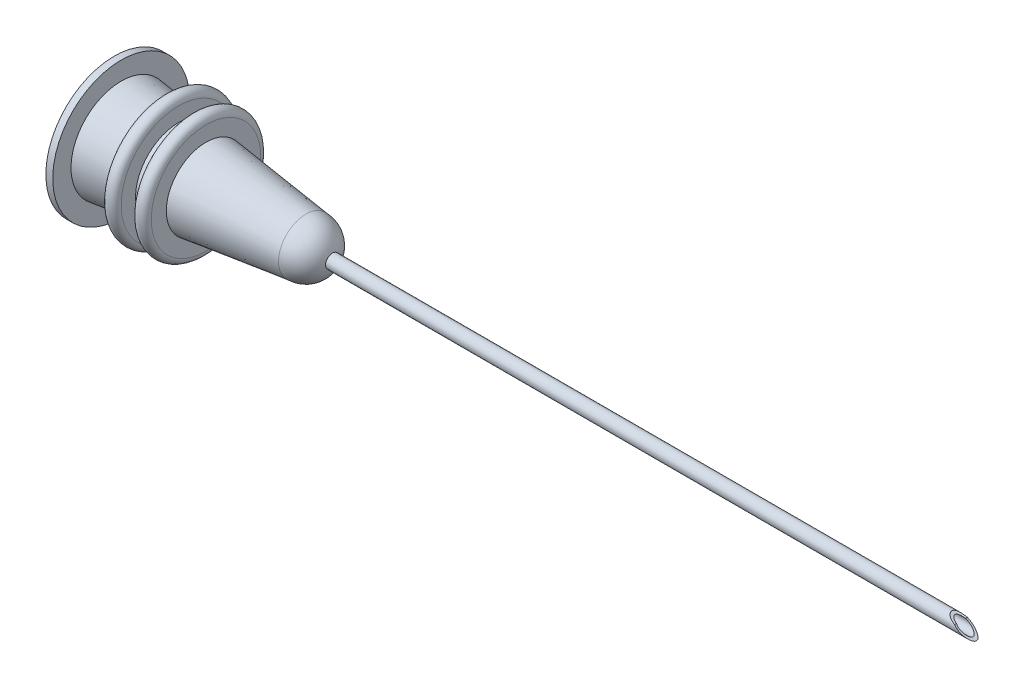
ISO-10303-21;
HEADER;
FILE_DESCRIPTION(('STEP AP214'),'2;1');
FILE_NAME('part.step','',(''),(''),'','','');
FILE_SCHEMA(('AUTOMOTIVE_DESIGN { 1 0 10303 214 1 1 1 1 }'));
ENDSEC;
DATA;
#1=APPLICATION_CONTEXT('core data for automotive mechanical design processes');
#2=APPLICATION_PROTOCOL_DEFINITION('international standard','automotive_design',2000,#1);
#3=PRODUCT_CONTEXT('',#1,'mechanical');
#4=PRODUCT('Part','Part','',(#3));
#5=PRODUCT_RELATED_PRODUCT_CATEGORY('part','',(#4));
#6=PRODUCT_DEFINITION_FORMATION('','',#4);
#7=PRODUCT_DEFINITION_CONTEXT('part definition',#1,'design');
#8=PRODUCT_DEFINITION('design','',#6,#7);
#9=PRODUCT_DEFINITION_SHAPE('','',#8);
#10=(LENGTH_UNIT() NAMED_UNIT(*) SI_UNIT(.MILLI.,.METRE.));
#11=(NAMED_UNIT(*) PLANE_ANGLE_UNIT() SI_UNIT($,.RADIAN.));
#12=(NAMED_UNIT(*) SI_UNIT($,.STERADIAN.) SOLID_ANGLE_UNIT());
#13=UNCERTAINTY_MEASURE_WITH_UNIT(LENGTH_MEASURE(1.E-05),#10,'distance_accuracy_value','');
#14=(GEOMETRIC_REPRESENTATION_CONTEXT(3) GLOBAL_UNCERTAINTY_ASSIGNED_CONTEXT((#13)) GLOBAL_UNIT_ASSIGNED_CONTEXT((#10,
#11,#12)) REPRESENTATION_CONTEXT('',''));
#15=CARTESIAN_POINT('',(0.,0.,0.));
#16=DIRECTION('',(0.,0.,1.));
#17=DIRECTION('',(1.,0.,0.));
#18=AXIS2_PLACEMENT_3D('',#15,#16,#17);
#19=CARTESIAN_POINT('',(0.,0.,0.));
#20=DIRECTION('',(0.,0.,1.));
#21=DIRECTION('',(1.,0.,0.));
#22=AXIS2_PLACEMENT_3D('',#19,#20,#21);
#23=SPHERICAL_SURFACE('',#22,2.);
#24=CARTESIAN_POINT('',(0.,0.,0.));
#25=DIRECTION('',(-1.,0.,0.));
#26=DIRECTION('',(0.,0.,1.));
#27=AXIS2_PLACEMENT_3D('',#24,#25,#26);
#28=SPHERICAL_SURFACE('',#27,2.);
#29=CARTESIAN_POINT('',(1.93649167310371,0.,0.));
#30=DIRECTION('',(-1.,0.,0.));
#31=DIRECTION('',(0.,0.,1.));
#32=AXIS2_PLACEMENT_3D('',#29,#30,#31);
#33=CIRCLE('',#32,0.5);
#34=CARTESIAN_POINT('',(1.93649167310371,0.,0.5));
#35=VERTEX_POINT('',#34);
#36=EDGE_CURVE('E210',#35,#35,#33,.F.);
#37=ORIENTED_EDGE('',*,*,#36,.F.);
#38=EDGE_LOOP('',(#37));
#39=FACE_BOUND('',#38,.T.);
#40=CARTESIAN_POINT('',(0.,0.,0.));
#41=DIRECTION('',(1.,0.,0.));
#42=DIRECTION('',(0.,0.,-1.));
#43=AXIS2_PLACEMENT_3D('',#40,#41,#42);
#44=CIRCLE('',#43,2.);
#45=CARTESIAN_POINT('',(0.,0.,-2.));
#46=VERTEX_POINT('',#45);
#47=EDGE_CURVE('E73',#46,#46,#44,.T.);
#48=ORIENTED_EDGE('',*,*,#47,.T.);
#49=EDGE_LOOP('',(#48));
#50=FACE_BOUND('',#49,.T.);
#51=ADVANCED_FACE('F38',(#39,#50),#28,.T.);
#52=CARTESIAN_POINT('',(0.,0.,0.));
#53=DIRECTION('',(-1.,0.,0.));
#54=DIRECTION('',(0.,0.,1.));
#55=AXIS2_PLACEMENT_3D('',#52,#53,#54);
#56=CONICAL_SURFACE('',#55,2.,0.122609377811233);
#57=CARTESIAN_POINT('',(-7.3,0.,0.));
#58=DIRECTION('',(1.,0.,0.));
#59=DIRECTION('',(0.,0.,-1.));
#60=AXIS2_PLACEMENT_3D('',#57,#58,#59);
#61=CIRCLE('',#60,2.89956069866158);
#62=CARTESIAN_POINT('',(-7.3,0.,-2.89956069866158));
#63=VERTEX_POINT('',#62);
#64=EDGE_CURVE('E75',#63,#63,#61,.T.);
#65=ORIENTED_EDGE('',*,*,#64,.T.);
#66=EDGE_LOOP('',(#65));
#67=FACE_BOUND('',#66,.T.);
#68=ORIENTED_EDGE('',*,*,#47,.F.);
#69=EDGE_LOOP('',(#68));
#70=FACE_BOUND('',#69,.T.);
#71=ADVANCED_FACE('F160',(#67,#70),#56,.T.);
#72=CARTESIAN_POINT('',(-7.3,4.,0.));
#73=DIRECTION('',(1.,0.,0.));
#74=DIRECTION('',(0.,0.,-1.));
#75=AXIS2_PLACEMENT_3D('',#72,#73,#74);
#76=PLANE('',#75);
#77=CARTESIAN_POINT('',(-7.3,0.,0.));
#78=DIRECTION('',(1.,0.,0.));
#79=DIRECTION('',(0.,0.,-1.));
#80=AXIS2_PLACEMENT_3D('',#77,#78,#79);
#81=CIRCLE('',#80,4.);
#82=CARTESIAN_POINT('',(-7.3,0.,-4.));
#83=VERTEX_POINT('',#82);
#84=EDGE_CURVE('E174',#83,#83,#81,.T.);
#85=ORIENTED_EDGE('',*,*,#84,.T.);
#86=EDGE_LOOP('',(#85));
#87=FACE_BOUND('',#86,.T.);
#88=ORIENTED_EDGE('',*,*,#64,.F.);
#89=EDGE_LOOP('',(#88));
#90=FACE_BOUND('',#89,.T.);
#91=ADVANCED_FACE('F157',(#87,#90),#76,.T.);
#92=CARTESIAN_POINT('',(-7.8,0.,0.));
#93=DIRECTION('',(1.,0.,0.));
#94=DIRECTION('',(0.,0.,-1.));
#95=AXIS2_PLACEMENT_3D('',#92,#93,#94);
#96=TOROIDAL_SURFACE('',#95,4.,0.5);
#97=CARTESIAN_POINT('',(-8.3,0.,0.));
#98=DIRECTION('',(1.,0.,0.));
#99=DIRECTION('',(0.,0.,-1.));
#100=AXIS2_PLACEMENT_3D('',#97,#98,#99);
#101=CIRCLE('',#100,4.);
#102=CARTESIAN_POINT('',(-8.3,0.,-4.));
#103=VERTEX_POINT('',#102);
#104=EDGE_CURVE('E176',#103,#103,#101,.T.);
#105=ORIENTED_EDGE('',*,*,#104,.T.);
#106=EDGE_LOOP('',(#105));
#107=FACE_BOUND('',#106,.T.);
#108=ORIENTED_EDGE('',*,*,#84,.F.);
#109=EDGE_LOOP('',(#108));
#110=FACE_BOUND('',#109,.T.);
#111=ADVANCED_FACE('F153',(#107,#110),#96,.T.);
#112=CARTESIAN_POINT('',(-8.3,4.,0.));
#113=DIRECTION('',(-1.,0.,0.));
#114=DIRECTION('',(0.,0.,1.));
#115=AXIS2_PLACEMENT_3D('',#112,#113,#114);
#116=PLANE('',#115);
#117=CARTESIAN_POINT('',(-8.3,0.,0.));
#118=DIRECTION('',(1.,0.,0.));
#119=DIRECTION('',(0.,0.,-1.));
#120=AXIS2_PLACEMENT_3D('',#117,#118,#119);
#121=CIRCLE('',#120,3.02278819162892);
#122=CARTESIAN_POINT('',(-8.3,0.,-3.02278819162892));
#123=VERTEX_POINT('',#122);
#124=EDGE_CURVE('E181',#123,#123,#121,.T.);
#125=ORIENTED_EDGE('',*,*,#124,.T.);
#126=EDGE_LOOP('',(#125));
#127=FACE_BOUND('',#126,.T.);
#128=ORIENTED_EDGE('',*,*,#104,.F.);
#129=EDGE_LOOP('',(#128));
#130=FACE_BOUND('',#129,.T.);
#131=ADVANCED_FACE('F149',(#127,#130),#116,.T.);
#132=CARTESIAN_POINT('',(-8.3,0.,0.));
#133=DIRECTION('',(-1.,0.,0.));
#134=DIRECTION('',(0.,0.,1.));
#135=AXIS2_PLACEMENT_3D('',#132,#133,#134);
#136=CONICAL_SURFACE('',#135,3.02278819162892,0.122609377811233);
#137=CARTESIAN_POINT('',(-9.3,0.,0.));
#138=DIRECTION('',(1.,0.,0.));
#139=DIRECTION('',(0.,0.,-1.));
#140=AXIS2_PLACEMENT_3D('',#137,#138,#139);
#141=CIRCLE('',#140,3.14601568459626);
#142=CARTESIAN_POINT('',(-9.3,0.,-3.14601568459626));
#143=VERTEX_POINT('',#142);
#144=EDGE_CURVE('E184',#143,#143,#141,.T.);
#145=ORIENTED_EDGE('',*,*,#144,.T.);
#146=EDGE_LOOP('',(#145));
#147=FACE_BOUND('',#146,.T.);
#148=ORIENTED_EDGE('',*,*,#124,.F.);
#149=EDGE_LOOP('',(#148));
#150=FACE_BOUND('',#149,.T.);
#151=ADVANCED_FACE('F145',(#147,#150),#136,.T.);
#152=CARTESIAN_POINT('',(-9.3,4.2,0.));
#153=DIRECTION('',(1.,0.,0.));
#154=DIRECTION('',(0.,0.,-1.));
#155=AXIS2_PLACEMENT_3D('',#152,#153,#154);
#156=PLANE('',#155);
#157=CARTESIAN_POINT('',(-9.3,0.,0.));
#158=DIRECTION('',(1.,0.,0.));
#159=DIRECTION('',(0.,0.,-1.));
#160=AXIS2_PLACEMENT_3D('',#157,#158,#159);
#161=CIRCLE('',#160,4.2);
#162=CARTESIAN_POINT('',(-9.3,0.,-4.2));
#163=VERTEX_POINT('',#162);
#164=EDGE_CURVE('E187',#163,#163,#161,.T.);
#165=ORIENTED_EDGE('',*,*,#164,.T.);
#166=EDGE_LOOP('',(#165));
#167=FACE_BOUND('',#166,.T.);
#168=ORIENTED_EDGE('',*,*,#144,.F.);
#169=EDGE_LOOP('',(#168));
#170=FACE_BOUND('',#169,.T.);
#171=ADVANCED_FACE('F141',(#167,#170),#156,.T.);
#172=CARTESIAN_POINT('',(-9.8,0.,0.));
#173=DIRECTION('',(1.,0.,0.));
#174=DIRECTION('',(0.,0.,-1.));
#175=AXIS2_PLACEMENT_3D('',#172,#173,#174);
#176=TOROIDAL_SURFACE('',#175,4.2,0.5);
#177=CARTESIAN_POINT('',(-10.3,0.,0.));
#178=DIRECTION('',(1.,0.,0.));
#179=DIRECTION('',(0.,0.,-1.));
#180=AXIS2_PLACEMENT_3D('',#177,#178,#179);
#181=CIRCLE('',#180,4.2);
#182=CARTESIAN_POINT('',(-10.3,0.,-4.2));
#183=VERTEX_POINT('',#182);
#184=EDGE_CURVE('E190',#183,#183,#181,.T.);
#185=ORIENTED_EDGE('',*,*,#184,.T.);
#186=EDGE_LOOP('',(#185));
#187=FACE_BOUND('',#186,.T.);
#188=ORIENTED_EDGE('',*,*,#164,.F.);
#189=EDGE_LOOP('',(#188));
#190=FACE_BOUND('',#189,.T.);
#191=ADVANCED_FACE('F137',(#187,#190),#176,.T.);
#192=CARTESIAN_POINT('',(-10.3,4.2,0.));
#193=DIRECTION('',(-1.,0.,0.));
#194=DIRECTION('',(0.,0.,1.));
#195=AXIS2_PLACEMENT_3D('',#192,#193,#194);
#196=PLANE('',#195);
#197=CARTESIAN_POINT('',(-10.3,0.,0.));
#198=DIRECTION('',(1.,0.,0.));
#199=DIRECTION('',(0.,0.,-1.));
#200=AXIS2_PLACEMENT_3D('',#197,#198,#199);
#201=CIRCLE('',#200,3.2692431775636);
#202=CARTESIAN_POINT('',(-10.3,0.,-3.2692431775636));
#203=VERTEX_POINT('',#202);
#204=EDGE_CURVE('E193',#203,#203,#201,.T.);
#205=ORIENTED_EDGE('',*,*,#204,.T.);
#206=EDGE_LOOP('',(#205));
#207=FACE_BOUND('',#206,.T.);
#208=ORIENTED_EDGE('',*,*,#184,.F.);
#209=EDGE_LOOP('',(#208));
#210=FACE_BOUND('',#209,.T.);
#211=ADVANCED_FACE('F133',(#207,#210),#196,.T.);
#212=CARTESIAN_POINT('',(-10.3,0.,0.));
#213=DIRECTION('',(-1.,0.,0.));
#214=DIRECTION('',(0.,0.,1.));
#215=AXIS2_PLACEMENT_3D('',#212,#213,#214);
#216=CONICAL_SURFACE('',#215,3.2692431775636,0.122609377811233);
#217=CARTESIAN_POINT('',(-13.5,0.,0.));
#218=DIRECTION('',(1.,0.,0.));
#219=DIRECTION('',(0.,0.,-1.));
#220=AXIS2_PLACEMENT_3D('',#217,#218,#219);
#221=CIRCLE('',#220,3.66357115505909);
#222=CARTESIAN_POINT('',(-13.5,0.,-3.66357115505909));
#223=VERTEX_POINT('',#222);
#224=EDGE_CURVE('E196',#223,#223,#221,.T.);
#225=ORIENTED_EDGE('',*,*,#224,.T.);
#226=EDGE_LOOP('',(#225));
#227=FACE_BOUND('',#226,.T.);
#228=ORIENTED_EDGE('',*,*,#204,.F.);
#229=EDGE_LOOP('',(#228));
#230=FACE_BOUND('',#229,.T.);
#231=ADVANCED_FACE('F129',(#227,#230),#216,.T.);
#232=CARTESIAN_POINT('',(-13.5,3.66357115505909,0.));
#233=DIRECTION('',(1.,0.,0.));
#234=DIRECTION('',(0.,0.,-1.));
#235=AXIS2_PLACEMENT_3D('',#232,#233,#234);
#236=PLANE('',#235);
#237=CARTESIAN_POINT('',(-13.5,0.,0.));
#238=DIRECTION('',(1.,0.,0.));
#239=DIRECTION('',(0.,0.,-1.));
#240=AXIS2_PLACEMENT_3D('',#237,#238,#239);
#241=CIRCLE('',#240,5.);
#242=CARTESIAN_POINT('',(-13.5,0.,-5.));
#243=VERTEX_POINT('',#242);
#244=EDGE_CURVE('E199',#243,#243,#241,.T.);
#245=ORIENTED_EDGE('',*,*,#244,.T.);
#246=EDGE_LOOP('',(#245));
#247=FACE_BOUND('',#246,.T.);
#248=ORIENTED_EDGE('',*,*,#224,.F.);
#249=EDGE_LOOP('',(#248));
#250=FACE_BOUND('',#249,.T.);
#251=ADVANCED_FACE('F125',(#247,#250),#236,.T.);
#252=CARTESIAN_POINT('',(0.,0.,0.));
#253=DIRECTION('',(1.,0.,0.));
#254=DIRECTION('',(0.,0.,-1.));
#255=AXIS2_PLACEMENT_3D('',#252,#253,#254);
#256=CYLINDRICAL_SURFACE('',#255,5.);
#257=CARTESIAN_POINT('',(-14.,0.,0.));
#258=DIRECTION('',(1.,0.,0.));
#259=DIRECTION('',(0.,0.,-1.));
#260=AXIS2_PLACEMENT_3D('',#257,#258,#259);
#261=CIRCLE('',#260,5.);
#262=CARTESIAN_POINT('',(-14.,0.,-5.));
#263=VERTEX_POINT('',#262);
#264=EDGE_CURVE('E202',#263,#263,#261,.T.);
#265=ORIENTED_EDGE('',*,*,#264,.T.);
#266=EDGE_LOOP('',(#265));
#267=FACE_BOUND('',#266,.T.);
#268=ORIENTED_EDGE('',*,*,#244,.F.);
#269=EDGE_LOOP('',(#268));
#270=FACE_BOUND('',#269,.T.);
#271=ADVANCED_FACE('F121',(#267,#270),#256,.T.);
#272=CARTESIAN_POINT('',(-14.,5.,0.));
#273=DIRECTION('',(-1.,0.,0.));
#274=DIRECTION('',(0.,0.,1.));
#275=AXIS2_PLACEMENT_3D('',#272,#273,#274);
#276=PLANE('',#275);
#277=CARTESIAN_POINT('',(-14.,0.,0.));
#278=DIRECTION('',(1.,0.,0.));
#279=DIRECTION('',(0.,0.,-1.));
#280=AXIS2_PLACEMENT_3D('',#277,#278,#279);
#281=CIRCLE('',#280,2.96951197563469);
#282=CARTESIAN_POINT('',(-14.,0.,-2.96951197563469));
#283=VERTEX_POINT('',#282);
#284=EDGE_CURVE('E205',#283,#283,#281,.T.);
#285=ORIENTED_EDGE('',*,*,#284,.T.);
#286=EDGE_LOOP('',(#285));
#287=FACE_BOUND('',#286,.T.);
#288=ORIENTED_EDGE('',*,*,#264,.F.);
#289=EDGE_LOOP('',(#288));
#290=FACE_BOUND('',#289,.T.);
#291=ADVANCED_FACE('F117',(#287,#290),#276,.T.);
#292=CARTESIAN_POINT('',(-14.,0.,0.));
#293=DIRECTION('',(-1.,0.,0.));
#294=DIRECTION('',(0.,0.,1.));
#295=AXIS2_PLACEMENT_3D('',#292,#293,#294);
#296=CONICAL_SURFACE('',#295,2.96951197563469,0.122609377811233);
#297=CARTESIAN_POINT('',(-0.999999999999999,0.,0.));
#298=DIRECTION('',(1.,0.,0.));
#299=DIRECTION('',(0.,0.,-1.));
#300=AXIS2_PLACEMENT_3D('',#297,#298,#299);
#301=CIRCLE('',#300,1.36755456705928);
#302=CARTESIAN_POINT('',(-0.999999999999999,0.,-1.36755456705928));
#303=VERTEX_POINT('',#302);
#304=EDGE_CURVE('E208',#303,#303,#301,.T.);
#305=ORIENTED_EDGE('',*,*,#304,.T.);
#306=EDGE_LOOP('',(#305));
#307=FACE_BOUND('',#306,.T.);
#308=ORIENTED_EDGE('',*,*,#284,.F.);
#309=EDGE_LOOP('',(#308));
#310=FACE_BOUND('',#309,.T.);
#311=ADVANCED_FACE('F113',(#307,#310),#296,.F.);
#312=CARTESIAN_POINT('',(-1.,1.36755456705928,0.));
#313=DIRECTION('',(-1.,0.,0.));
#314=DIRECTION('',(0.,0.,1.));
#315=AXIS2_PLACEMENT_3D('',#312,#313,#314);
#316=PLANE('',#315);
#317=ORIENTED_EDGE('',*,*,#304,.F.);
#318=EDGE_LOOP('',(#317));
#319=FACE_BOUND('',#318,.T.);
#320=CARTESIAN_POINT('',(-1.,0.,0.));
#321=DIRECTION('',(-1.,0.,0.));
#322=DIRECTION('',(0.,0.,1.));
#323=AXIS2_PLACEMENT_3D('',#320,#321,#322);
#324=CIRCLE('',#323,0.375);
#325=CARTESIAN_POINT('',(-1.,0.,0.375));
#326=VERTEX_POINT('',#325);
#327=EDGE_CURVE('E99',#326,#326,#324,.T.);
#328=ORIENTED_EDGE('',*,*,#327,.F.);
#329=EDGE_LOOP('',(#328));
#330=FACE_BOUND('',#329,.T.);
#331=ADVANCED_FACE('F108',(#319,#330),#316,.T.);
#332=CARTESIAN_POINT('',(49.,0.,0.));
#333=DIRECTION('',(-1.,0.,0.));
#334=DIRECTION('',(0.,0.,1.));
#335=AXIS2_PLACEMENT_3D('',#332,#333,#334);
#336=CYLINDRICAL_SURFACE('',#335,0.5);
#337=CARTESIAN_POINT('',(49.,0.,-0.5));
#338=CARTESIAN_POINT('',(48.9583904464747,7.99673527458866E-08,-0.499994803298946));
#339=CARTESIAN_POINT('',(48.9167847254722,0.000742115513359217,-0.500000699921479));
#340=CARTESIAN_POINT('',(48.8336253744731,0.00370895092813866,-0.499989394064269));
#341=CARTESIAN_POINT('',(48.792071745517,0.00593377995719239,-0.499972191130249));
#342=CARTESIAN_POINT('',(48.6674118848881,0.0148411402855793,-0.499817818955422));
#343=CARTESIAN_POINT('',(48.5844535810992,0.0237565455544011,-0.499577585148702));
#344=CARTESIAN_POINT('',(48.4169432825375,0.0478382860272779,-0.497856255421235));
#345=CARTESIAN_POINT('',(48.3324174936529,0.063183028788661,-0.496338385050073));
#346=CARTESIAN_POINT('',(48.1648805450954,0.10001312317582,-0.490255252748027));
#347=CARTESIAN_POINT('',(48.0818676852382,0.121491063501162,-0.485693659984475));
#348=CARTESIAN_POINT('',(47.9596030795196,0.157941447869739,-0.474562469753925));
#349=CARTESIAN_POINT('',(47.9194849914223,0.170698035666228,-0.470180555173614));
#350=CARTESIAN_POINT('',(47.8399333663788,0.197575650367584,-0.45953687138437));
#351=CARTESIAN_POINT('',(47.8005000872512,0.21169717855188,-0.45327440974508));
#352=CARTESIAN_POINT('',(47.722915270225,0.241049302382518,-0.438364892673407));
#353=CARTESIAN_POINT('',(47.6847553892126,0.256268768910115,-0.429739812563381));
#354=CARTESIAN_POINT('',(47.6097252192644,0.287713508448098,-0.40935689228756));
#355=CARTESIAN_POINT('',(47.5728534926489,0.303937600222464,-0.397602679622689));
#356=CARTESIAN_POINT('',(47.5128661440604,0.331540481008059,-0.374549876832645));
#357=CARTESIAN_POINT('',(47.4892365292266,0.342745772960858,-0.36438798634291));
#358=CARTESIAN_POINT('',(47.4430556379542,0.365261804181131,-0.341816851227128));
#359=CARTESIAN_POINT('',(47.4205059784337,0.376572673019895,-0.32940436225217));
#360=CARTESIAN_POINT('',(47.3768046784772,0.399057398946941,-0.301783420635359));
#361=CARTESIAN_POINT('',(47.3556647263046,0.41022960373391,-0.286554794683706));
#362=CARTESIAN_POINT('',(47.3157151122843,0.431825297276897,-0.252837038529335));
#363=CARTESIAN_POINT('',(47.2969006298143,0.4422503154037,-0.2343548525662));
#364=CARTESIAN_POINT('',(47.2687262244161,0.458149245183981,-0.200780968946547));
#365=CARTESIAN_POINT('',(47.2583587285163,0.464081033678559,-0.186758291166866));
#366=CARTESIAN_POINT('',(47.239560520521,0.474942938073186,-0.15709339331814));
#367=CARTESIAN_POINT('',(47.2311291954037,0.479873370960629,-0.141451688140036));
#368=CARTESIAN_POINT('',(47.2166666265028,0.488390104026615,-0.108480043032754));
#369=CARTESIAN_POINT('',(47.2106663897658,0.491959007160746,-0.0911315991674419));
#370=CARTESIAN_POINT('',(47.2018019565138,0.497249310117114,-0.0553843135358243));
#371=CARTESIAN_POINT('',(47.1989322410427,0.498973961159397,-0.0369873806716265));
#372=CARTESIAN_POINT('',(47.1968218353719,0.500241795186489,-0.0027034684724461));
#373=CARTESIAN_POINT('',(47.1971000086102,0.500074206118567,0.013144598737856));
#374=CARTESIAN_POINT('',(47.2001189825966,0.498261940402622,0.0445176814329099));
#375=CARTESIAN_POINT('',(47.2028601919027,0.496617018700895,0.0600426428850881));
#376=CARTESIAN_POINT('',(47.2103117895527,0.492171377414629,0.0892841279112567));
#377=CARTESIAN_POINT('',(47.2148766121181,0.489456261078017,0.10305196613143));
#378=CARTESIAN_POINT('',(47.2256655709194,0.483084900462217,0.129678971269599));
#379=CARTESIAN_POINT('',(47.2318901059111,0.479428430024362,0.142537918880704));
#380=CARTESIAN_POINT('',(47.2496322634132,0.46909783865977,0.17424637431691));
#381=CARTESIAN_POINT('',(47.262150493485,0.46188787551741,0.192361180484092));
#382=CARTESIAN_POINT('',(47.28960869251,0.446344293853152,0.226105466199458));
#383=CARTESIAN_POINT('',(47.3045554639449,0.438007530460684,0.24172771300061));
#384=CARTESIAN_POINT('',(47.3462442427515,0.415206129522191,0.279946994603086));
#385=CARTESIAN_POINT('',(47.3744316882328,0.400222814352495,0.300642256121825));
#386=CARTESIAN_POINT('',(47.4335560090162,0.3699250599564,0.337223128487323));
#387=CARTESIAN_POINT('',(47.4644987112064,0.354609973418644,0.353098217328232));
#388=CARTESIAN_POINT('',(47.5275346471119,0.324619728109163,0.380827680333696));
#389=CARTESIAN_POINT('',(47.5595933290358,0.309937908317895,0.392754926319976));
#390=CARTESIAN_POINT('',(47.6249231613908,0.281235941951374,0.41378923021251));
#391=CARTESIAN_POINT('',(47.6581954666761,0.267216456369493,0.42289351925014));
#392=CARTESIAN_POINT('',(47.759475430869,0.226410289778905,0.446930135802772));
#393=CARTESIAN_POINT('',(47.8288015705031,0.200945266527597,0.458530024019008));
#394=CARTESIAN_POINT('',(47.9753984465591,0.152363436157451,0.476978485461348));
#395=CARTESIAN_POINT('',(48.0528461316099,0.129625755155942,0.4833438817778));
#396=CARTESIAN_POINT('',(48.2093982866885,0.0895036853085824,0.492351913364944));
#397=CARTESIAN_POINT('',(48.2885045391687,0.0721254082060551,0.494990310631259));
#398=CARTESIAN_POINT('',(48.4476853774398,0.042906612818956,0.498371474445398));
#399=CARTESIAN_POINT('',(48.5277590577392,0.0310612740754617,0.499115893607074));
#400=CARTESIAN_POINT('',(48.6884861864852,0.0129536418559133,0.499914979986723));
#401=CARTESIAN_POINT('',(48.7691391567331,0.00668718103451292,0.499970162457228));
#402=CARTESIAN_POINT('',(48.8749130413677,0.0021462244024727,0.499995660635806));
#403=CARTESIAN_POINT('',(48.8999422888126,0.00134085138135597,0.499998263581664));
#404=CARTESIAN_POINT('',(48.9499804378618,0.000268132540508595,0.500000442140695));
#405=CARTESIAN_POINT('',(48.9749893248102,1.03172217391055E-07,0.500000021603135));
#406=CARTESIAN_POINT('',(49.,0.,0.5));
#407=B_SPLINE_CURVE_WITH_KNOTS('',3,(#337,#338,#339,#340,#341,#342,#343,#344,#345,#346,#347,
#348,#349,#350,#351,#352,#353,#354,#355,#356,#357,#358,#359,#360,#361,#362,#363,#364,#365,#366,
#367,#368,#369,#370,#371,#372,#373,#374,#375,#376,#377,#378,#379,#380,#381,#382,#383,#384,#385,
#386,#387,#388,#389,#390,#391,#392,#393,#394,#395,#396,#397,#398,#399,#400,#401,#402,#403,#404,
#405,#406),.UNSPECIFIED.,.F.,.F.,(4,2,2,2,2,2,2,2,2,2,2,2,2,2,2,2,2,2,2,2,2,2,2,2,2,2,2,2,2,2,2,
2,2,2,4),(0.,0.124814384042121,0.249631222728075,0.499704596565313,0.757232215496293,
1.01444994778906,1.14137187366669,1.26834059049329,1.39416624727195,1.51984666892835,
1.60393189119591,1.68813930435157,1.77297510464743,1.85763198366323,1.91273336331846,
1.9678172728955,2.02358315965483,2.07925057419941,2.12654068640841,2.1738386443508,
2.21794082486963,2.26205361076343,2.33116467754336,2.40047277570452,2.51396061966749,
2.62769444530129,2.73919358516794,2.85080174439061,3.07452291406234,3.31711066821702,
3.55997404966043,3.80262544488755,4.04509543039419,4.12021806659996,4.19524507938975),.UNSPECIFIED.);
#408=CARTESIAN_POINT('',(47.8614010421319,0.190378811232083,-0.462337439792473));
#409=VERTEX_POINT('',#408);
#410=CARTESIAN_POINT('',(47.8614010421319,0.190378811232083,0.462337439792473));
#411=VERTEX_POINT('',#410);
#412=EDGE_CURVE('E92',#409,#411,#407,.T.);
#413=ORIENTED_EDGE('',*,*,#412,.F.);
#414=CARTESIAN_POINT('',(49.,-0.5,0.));
#415=CARTESIAN_POINT('',(49.0000005124618,-0.500000207355729,-0.0125909528909839));
#416=CARTESIAN_POINT('',(48.9988973767319,-0.499519234809843,-0.0251803973692698));
#417=CARTESIAN_POINT('',(48.9946350092743,-0.497655349963925,-0.0499385012717421));
#418=CARTESIAN_POINT('',(48.9914732444924,-0.496271326494273,-0.0621066228241094));
#419=CARTESIAN_POINT('',(48.9823563092796,-0.492262479074227,-0.0889280195617167));
#420=CARTESIAN_POINT('',(48.9758772393713,-0.48940345588389,-0.103364580234847));
#421=CARTESIAN_POINT('',(48.9609393218666,-0.482760971508321,-0.130935078608321));
#422=CARTESIAN_POINT('',(48.9524758727961,-0.478975360797057,-0.144065886120113));
#423=CARTESIAN_POINT('',(48.9275153352082,-0.467710472161099,-0.178239045217897));
#424=CARTESIAN_POINT('',(48.9096659117157,-0.459553038460227,-0.198054079829814));
#425=CARTESIAN_POINT('',(48.8717810342524,-0.441927259547519,-0.23476605590274));
#426=CARTESIAN_POINT('',(48.851739327943,-0.432455143089352,-0.251654276504805));
#427=CARTESIAN_POINT('',(48.8092878959211,-0.412017024766676,-0.283945989411702));
#428=CARTESIAN_POINT('',(48.7868090098062,-0.400998548477215,-0.299223979781188));
#429=CARTESIAN_POINT('',(48.7409833987655,-0.378086153442417,-0.327694695149538));
#430=CARTESIAN_POINT('',(48.7176358116827,-0.366191352847973,-0.340885276385706));
#431=CARTESIAN_POINT('',(48.6467011525839,-0.32931917044403,-0.377846909625646));
#432=CARTESIAN_POINT('',(48.5983064931674,-0.303194218455586,-0.398948572353165));
#433=CARTESIAN_POINT('',(48.5116434295749,-0.254472553826571,-0.431150455632949));
#434=CARTESIAN_POINT('',(48.4735100250777,-0.232378654642426,-0.443430906903332));
#435=CARTESIAN_POINT('',(48.3971104600884,-0.186726812587658,-0.464506651404057));
#436=CARTESIAN_POINT('',(48.3588442312142,-0.163167958156986,-0.473299749030291));
#437=CARTESIAN_POINT('',(48.282573326214,-0.114760315750188,-0.487302082271064));
#438=CARTESIAN_POINT('',(48.2445682950705,-0.0899140191581811,-0.49251798077831));
#439=CARTESIAN_POINT('',(48.1690259956952,-0.0390331707596784,-0.499133481519282));
#440=CARTESIAN_POINT('',(48.1314886539613,-0.0129988087461989,-0.500533691153066));
#441=CARTESIAN_POINT('',(48.0482455780525,0.046445257302097,-0.498927562939486));
#442=CARTESIAN_POINT('',(48.0027441156513,0.080124145655362,-0.494781695664623));
#443=CARTESIAN_POINT('',(47.9137717109363,0.148326395128305,-0.478773825724017));
#444=CARTESIAN_POINT('',(47.8702974622003,0.182848230447305,-0.466924894940705));
#445=CARTESIAN_POINT('',(47.7990873753449,0.241272096008406,-0.438752162381982));
#446=CARTESIAN_POINT('',(47.7705107135906,0.265284381245068,-0.424801054172238));
#447=CARTESIAN_POINT('',(47.7157304162491,0.312315004782396,-0.391519319774966));
#448=CARTESIAN_POINT('',(47.6895233727716,0.335334744750031,-0.372196587332175));
#449=CARTESIAN_POINT('',(47.6475525791964,0.372905362585786,-0.333831173526176));
#450=CARTESIAN_POINT('',(47.6309360033177,0.388005428325768,-0.316265799889607));
#451=CARTESIAN_POINT('',(47.600087878209,0.41637410571904,-0.277849988670346));
#452=CARTESIAN_POINT('',(47.5858529458001,0.429645310499886,-0.257004294023516));
#453=CARTESIAN_POINT('',(47.5630874986448,0.451070990568401,-0.216668103391159));
#454=CARTESIAN_POINT('',(47.5539856241199,0.4597171666662,-0.197764164466051));
#455=CARTESIAN_POINT('',(47.5381924423697,0.474805195656867,-0.15814025441044));
#456=CARTESIAN_POINT('',(47.5314998568906,0.481248217347275,-0.137421253542019));
#457=CARTESIAN_POINT('',(47.520893337094,0.491493306016106,-0.0944708469397563));
#458=CARTESIAN_POINT('',(47.5170001579987,0.495275641878065,-0.0722294566734642));
#459=CARTESIAN_POINT('',(47.5123694610005,0.499777274653022,-0.0271168805342242));
#460=CARTESIAN_POINT('',(47.5116300022618,0.500498455434737,-0.00424609072665163));
#461=CARTESIAN_POINT('',(47.5132539771268,0.498918024966597,0.0385080169191395));
#462=CARTESIAN_POINT('',(47.5152553379314,0.496969128003496,0.0584201718955558));
#463=CARTESIAN_POINT('',(47.5216131970898,0.490801109770033,0.0974963358523563));
#464=CARTESIAN_POINT('',(47.5259697582255,0.486581927981493,0.11666032487454));
#465=CARTESIAN_POINT('',(47.5368657837836,0.476087301402336,0.154020331730885));
#466=CARTESIAN_POINT('',(47.5434308295209,0.469787776017919,0.172201964800403));
#467=CARTESIAN_POINT('',(47.5584250557673,0.455501199935989,0.207060888106525));
#468=CARTESIAN_POINT('',(47.5668550894069,0.447513377009064,0.223737484939516));
#469=CARTESIAN_POINT('',(47.589714841899,0.426033266086479,0.263080275449753));
#470=CARTESIAN_POINT('',(47.6050799191378,0.411741513891853,0.284768630916899));
#471=CARTESIAN_POINT('',(47.6383818306927,0.381219503320736,0.324503752948605));
#472=CARTESIAN_POINT('',(47.6563246044694,0.364984782841593,0.342541870930251));
#473=CARTESIAN_POINT('',(47.7025210143635,0.323858118593175,0.382444080092323));
#474=CARTESIAN_POINT('',(47.7318113331719,0.298327089514048,0.402441902171906));
#475=CARTESIAN_POINT('',(47.7929800658604,0.246347043710287,0.436205873847513));
#476=CARTESIAN_POINT('',(47.8248621657757,0.219896751308745,0.449962958336858));
#477=CARTESIAN_POINT('',(47.9078283958452,0.152866087287851,0.478091109284277));
#478=CARTESIAN_POINT('',(47.9600964867726,0.112262309511031,0.488887498694187));
#479=CARTESIAN_POINT('',(48.0670020784229,0.0326366728156302,0.500558963882678));
#480=CARTESIAN_POINT('',(48.1216472997682,-0.00637908857633311,0.501398843337303));
#481=CARTESIAN_POINT('',(48.2144319440119,-0.0698560734920324,0.495765744064803));
#482=CARTESIAN_POINT('',(48.2522738905908,-0.094988743896891,0.491540865370264));
#483=CARTESIAN_POINT('',(48.3282187737208,-0.143962449973576,0.479490713597586));
#484=CARTESIAN_POINT('',(48.36632169173,-0.16780357635783,0.471665693745097));
#485=CARTESIAN_POINT('',(48.4423634200552,-0.213988917503074,0.452582378861437));
#486=CARTESIAN_POINT('',(48.480302304127,-0.236338472559676,0.441337233440527));
#487=CARTESIAN_POINT('',(48.5558126738647,-0.2795150042471,0.415339597052178));
#488=CARTESIAN_POINT('',(48.593384455557,-0.300343313786816,0.400590225866148));
#489=CARTESIAN_POINT('',(48.6559590907703,-0.334018864297569,0.372489684595177));
#490=CARTESIAN_POINT('',(48.6811861567437,-0.347310237810931,0.360166517670907));
#491=CARTESIAN_POINT('',(48.7311002530146,-0.373081913110665,0.333400458089945));
#492=CARTESIAN_POINT('',(48.7557846268843,-0.385558643647922,0.318949032528369));
#493=CARTESIAN_POINT('',(48.8111139461936,-0.412976311430085,0.283029235472363));
#494=CARTESIAN_POINT('',(48.841400607675,-0.427576356855475,0.260743111463114));
#495=CARTESIAN_POINT('',(48.8982701147684,-0.454348852429624,0.210646212952154));
#496=CARTESIAN_POINT('',(48.9248834069582,-0.466541670631287,0.182886151744353));
#497=CARTESIAN_POINT('',(48.9550180833392,-0.480113210586274,0.140092279107696));
#498=CARTESIAN_POINT('',(48.962358149907,-0.483392844161234,0.128406724746646));
#499=CARTESIAN_POINT('',(48.975475938997,-0.489223989864512,0.104007762155106));
#500=CARTESIAN_POINT('',(48.9812549401945,-0.491776098007413,0.0912952063029807));
#501=CARTESIAN_POINT('',(48.9904546486923,-0.495824904565758,0.0656917407073111));
#502=CARTESIAN_POINT('',(48.9939902333964,-0.497373123463732,0.0528515671350373));
#503=CARTESIAN_POINT('',(48.9987608387592,-0.499459771770725,0.0266731567627449));
#504=CARTESIAN_POINT('',(48.9999994572251,-0.499999780378776,0.0133357323105378));
#505=CARTESIAN_POINT('',(49.,-0.5,0.));
#506=B_SPLINE_CURVE_WITH_KNOTS('',3,(#414,#415,#416,#417,#418,#419,#420,#421,#422,#423,#424,
#425,#426,#427,#428,#429,#430,#431,#432,#433,#434,#435,#436,#437,#438,#439,#440,#441,#442,#443,
#444,#445,#446,#447,#448,#449,#450,#451,#452,#453,#454,#455,#456,#457,#458,#459,#460,#461,#462,
#463,#464,#465,#466,#467,#468,#469,#470,#471,#472,#473,#474,#475,#476,#477,#478,#479,#480,#481,
#482,#483,#484,#485,#486,#487,#488,#489,#490,#491,#492,#493,#494,#495,#496,#497,#498,#499,#500,
#501,#502,#503,#504,#505),.UNSPECIFIED.,.T.,.F.,(4,2,2,2,2,2,2,2,2,2,2,2,2,2,2,2,2,2,2,2,2,2,2,
2,2,2,2,2,2,2,2,2,2,2,2,2,2,2,2,2,2,2,2,2,2,4),(0.,0.0377171393239249,0.0754807758880129,
0.123446598823013,0.171524766870325,0.254722773433654,0.33816457033518,0.426012773857256,
0.51395061977075,0.690155197571436,0.827274241281502,0.964479477289651,1.10142845559556,
1.23835563241803,1.40818053954057,1.57771800818296,1.69692531488622,1.81595836096603,
1.90120441387978,1.98632832532865,2.05414059542095,2.12191683434377,2.19019053567791,
2.25842221452333,2.31845737033666,2.37849412656513,2.43925172309344,2.50003717059807,
2.590063563213,2.68030082221582,2.81067025081278,2.94122844844337,3.14131553751746,
3.34210972563428,3.47882789418194,3.61553644775784,3.75172589353516,3.88779454241784,
3.98091668391422,4.07442289530074,4.19516734257763,4.31484167914277,4.35728560279303,
4.39969465428998,4.43970555935149,4.47965374102591),.UNSPECIFIED.);
#507=EDGE_CURVE('E52',#411,#409,#506,.T.);
#508=ORIENTED_EDGE('',*,*,#507,.F.);
#509=EDGE_LOOP('',(#413,#508));
#510=FACE_BOUND('',#509,.T.);
#511=ORIENTED_EDGE('',*,*,#36,.T.);
#512=EDGE_LOOP('',(#511));
#513=FACE_BOUND('',#512,.T.);
#514=ADVANCED_FACE('F104',(#510,#513),#336,.T.);
#515=CARTESIAN_POINT('',(49.,0.,0.));
#516=DIRECTION('',(-1.,0.,0.));
#517=DIRECTION('',(0.,0.,1.));
#518=AXIS2_PLACEMENT_3D('',#515,#516,#517);
#519=CYLINDRICAL_SURFACE('',#518,0.375);
#520=CARTESIAN_POINT('',(49.,0.,-0.375));
#521=CARTESIAN_POINT('',(48.9687172882148,-1.55684867949866E-08,-0.374997730410719));
#522=CARTESIAN_POINT('',(48.9374360239019,0.000419420066799926,-0.375000271117309));
#523=CARTESIAN_POINT('',(48.874896182891,0.00209668931991924,-0.374995508331238));
#524=CARTESIAN_POINT('',(48.8436376060489,0.00335451756462611,-0.374988204901666));
#525=CARTESIAN_POINT('',(48.7498906909202,0.00838668396821072,-0.374922307720044));
#526=CARTESIAN_POINT('',(48.6874655632978,0.0134197032169251,-0.374819686800747));
#527=CARTESIAN_POINT('',(48.5621598569765,0.0269151720440397,-0.374094934786773));
#528=CARTESIAN_POINT('',(48.4992840658622,0.0354217984014876,-0.373465997701552));
#529=CARTESIAN_POINT('',(48.3741390689933,0.0558283461192805,-0.37096224739));
#530=CARTESIAN_POINT('',(48.3118696256459,0.0677268780926002,-0.369087943871211));
#531=CARTESIAN_POINT('',(48.1762176334091,0.0974896777727221,-0.362494425679048));
#532=CARTESIAN_POINT('',(48.1030038738212,0.116061498129649,-0.357296922874498));
#533=CARTESIAN_POINT('',(47.9948402994412,0.147231486687495,-0.345062996580087));
#534=CARTESIAN_POINT('',(47.9591485808886,0.158142346836339,-0.340262792015744));
#535=CARTESIAN_POINT('',(47.88842924391,0.180995938402501,-0.3286805707061));
#536=CARTESIAN_POINT('',(47.8534012720156,0.192938100643652,-0.32189964226183));
#537=CARTESIAN_POINT('',(47.7895569449259,0.215826417103354,-0.306922076587049));
#538=CARTESIAN_POINT('',(47.7606088701963,0.226646181046269,-0.299099759685881));
#539=CARTESIAN_POINT('',(47.7035658377778,0.248816281045741,-0.28093080452556));
#540=CARTESIAN_POINT('',(47.6754742867236,0.260168369953244,-0.270575272616138));
#541=CARTESIAN_POINT('',(47.6204415537865,0.28321262037368,-0.246374628288589));
#542=CARTESIAN_POINT('',(47.5935207909359,0.294907299719374,-0.232484682520518));
#543=CARTESIAN_POINT('',(47.542453067027,0.317812018894777,-0.200037013049557));
#544=CARTESIAN_POINT('',(47.5182875296401,0.329024941946787,-0.18151361847955));
#545=CARTESIAN_POINT('',(47.4885879956568,0.343147006404318,-0.151517482910573));
#546=CARTESIAN_POINT('',(47.4807544780891,0.346912633235461,-0.14274131572748));
#547=CARTESIAN_POINT('',(47.466149732505,0.353991709482664,-0.124153987343393));
#548=CARTESIAN_POINT('',(47.4593790714284,0.357304917451597,-0.114342278407457));
#549=CARTESIAN_POINT('',(47.4471951459178,0.363306820800262,-0.0935488790342786));
#550=CARTESIAN_POINT('',(47.441798713505,0.36598774488685,-0.0825548282731217));
#551=CARTESIAN_POINT('',(47.4329361618969,0.370409625561529,-0.0596384123347216));
#552=CARTESIAN_POINT('',(47.4294655795611,0.372152755191555,-0.0477182671459796));
#553=CARTESIAN_POINT('',(47.4253740356653,0.374210979880056,-0.0260973761516894));
#554=CARTESIAN_POINT('',(47.4242850488299,0.374760415558572,-0.01650705232132));
#555=CARTESIAN_POINT('',(47.4235854115202,0.375113236269557,0.00274091909755659));
#556=CARTESIAN_POINT('',(47.4239742495065,0.374916879453221,0.0123985422356512));
#557=CARTESIAN_POINT('',(47.4261937789791,0.37379856841004,0.0314783082212502));
#558=CARTESIAN_POINT('',(47.428021390673,0.372878164058971,0.0409009097521701));
#559=CARTESIAN_POINT('',(47.4329672810218,0.370396823510799,0.0593103331309047));
#560=CARTESIAN_POINT('',(47.4360864724416,0.36883543433364,0.0682968417622233));
#561=CARTESIAN_POINT('',(47.4449114074443,0.36444067492859,0.0892445034188047));
#562=CARTESIAN_POINT('',(47.4511532203266,0.361348251077627,0.100924509260627));
#563=CARTESIAN_POINT('',(47.4652435708934,0.354434116411921,0.123029962748577));
#564=CARTESIAN_POINT('',(47.4730959500643,0.350610663469764,0.133452314470483));
#565=CARTESIAN_POINT('',(47.4951173527453,0.340007413987133,0.159104809731499));
#566=CARTESIAN_POINT('',(47.5102119435455,0.332849945783253,0.173375725748716));
#567=CARTESIAN_POINT('',(47.5422188328781,0.317989819474896,0.199327373741425));
#568=CARTESIAN_POINT('',(47.559135304399,0.310285924171896,0.211001963192124));
#569=CARTESIAN_POINT('',(47.5938841908295,0.294817510471767,0.232111885433174));
#570=CARTESIAN_POINT('',(47.6116998598329,0.287055472301047,0.241577108443952));
#571=CARTESIAN_POINT('',(47.6481270772305,0.271558683850846,0.258872913332511));
#572=CARTESIAN_POINT('',(47.6667394025818,0.263823968558994,0.266701853510904));
#573=CARTESIAN_POINT('',(47.7234954657028,0.240828643240656,0.288221979360717));
#574=CARTESIAN_POINT('',(47.7624935990455,0.225805889345209,0.299910687571332));
#575=CARTESIAN_POINT('',(47.8311809467799,0.200784097303967,0.316972656081169));
#576=CARTESIAN_POINT('',(47.860579195977,0.190513723536493,0.323198839807121));
#577=CARTESIAN_POINT('',(47.9199016852071,0.170681046524752,0.334097393476863));
#578=CARTESIAN_POINT('',(47.9498259738198,0.161118809106461,0.338769619110508));
#579=CARTESIAN_POINT('',(48.0402935031755,0.133556780948052,0.350991988007611));
#580=CARTESIAN_POINT('',(48.1014339254747,0.116717300381994,0.356726278640356));
#581=CARTESIAN_POINT('',(48.2249074268227,0.0863078711491084,0.365271479261492));
#582=CARTESIAN_POINT('',(48.2872438492931,0.0727492125355718,0.368072401868071));
#583=CARTESIAN_POINT('',(48.4126242104235,0.0490492101461754,0.371971613060237));
#584=CARTESIAN_POINT('',(48.4756683266719,0.0389087448771605,0.37306946420168));
#585=CARTESIAN_POINT('',(48.6156596681306,0.0203061254184714,0.374591842040001));
#586=CARTESIAN_POINT('',(48.69271856714,0.0126566116843215,0.374824075379576));
#587=CARTESIAN_POINT('',(48.8082254524175,0.00504702906507022,0.37497294324757));
#588=CARTESIAN_POINT('',(48.8465564041058,0.00315458038644508,0.374989654310609));
#589=CARTESIAN_POINT('',(48.9232571271157,0.000631144046245642,0.375000791274415));
#590=CARTESIAN_POINT('',(48.9616268955279,6.79694462004316E-08,0.374995218737221));
#591=CARTESIAN_POINT('',(49.,0.,0.375));
#592=B_SPLINE_CURVE_WITH_KNOTS('',3,(#520,#521,#522,#523,#524,#525,#526,#527,#528,#529,#530,
#531,#532,#533,#534,#535,#536,#537,#538,#539,#540,#541,#542,#543,#544,#545,#546,#547,#548,#549,
#550,#551,#552,#553,#554,#555,#556,#557,#558,#559,#560,#561,#562,#563,#564,#565,#566,#567,#568,
#569,#570,#571,#572,#573,#574,#575,#576,#577,#578,#579,#580,#581,#582,#583,#584,#585,#586,#587,
#588,#589,#590,#591),.UNSPECIFIED.,.F.,.F.,(4,2,2,2,2,2,2,2,2,2,2,2,2,2,2,2,2,2,2,2,2,2,2,2,2,2,
2,2,2,2,2,2,2,2,2,4),(0.,0.0938424300048455,0.187684258594172,0.375470966145741,
0.56572422644615,0.755899667211298,0.982692603819968,1.09552981825861,1.20830515097414,
1.3038587613546,1.39975278269644,1.49692976621253,1.59340705394758,1.63038731742254,
1.66738724004742,1.70482063886852,1.74216691989576,1.77103568317808,1.79989445463759,
1.82869161936294,1.85750916999757,1.89807681842137,1.93874237724188,2.00428485338187,
2.0699807816105,2.13472841758392,2.19954070694477,2.32940135326464,2.42463087791821,
2.51986924370579,2.71066252189607,2.90210331210591,3.09359326689648,3.32571385132296,
3.44082937461406,3.55593682866226),.UNSPECIFIED.);
#593=CARTESIAN_POINT('',(47.8614010421319,0.190378811232083,-0.323080343310853));
#594=VERTEX_POINT('',#593);
#595=CARTESIAN_POINT('',(47.8614010421319,0.190378811232083,0.323080343310853));
#596=VERTEX_POINT('',#595);
#597=EDGE_CURVE('E66',#594,#596,#592,.T.);
#598=ORIENTED_EDGE('',*,*,#597,.T.);
#599=CARTESIAN_POINT('',(48.113379883851,0.,0.375));
#600=CARTESIAN_POINT('',(48.1652986012757,-0.0367065171142796,0.375008708797557));
#601=CARTESIAN_POINT('',(48.2179819182089,-0.0724562931742304,0.369672609766786));
#602=CARTESIAN_POINT('',(48.2969281967497,-0.123896064690456,0.354391365275304));
#603=CARTESIAN_POINT('',(48.3232603752488,-0.140696344868213,0.348073438337936));
#604=CARTESIAN_POINT('',(48.3757095511935,-0.173484795932267,0.332948008085019));
#605=CARTESIAN_POINT('',(48.4018266886459,-0.189473537175146,0.324142282616214));
#606=CARTESIAN_POINT('',(48.4529441722103,-0.220141401263734,0.304121830332407));
#607=CARTESIAN_POINT('',(48.4779561938488,-0.23484304143578,0.29297156608409));
#608=CARTESIAN_POINT('',(48.527142666039,-0.263201434047656,0.267788364980309));
#609=CARTESIAN_POINT('',(48.5513172536932,-0.276858357972242,0.253755902622204));
#610=CARTESIAN_POINT('',(48.593474592655,-0.300242854236771,0.225274732214002));
#611=CARTESIAN_POINT('',(48.6117401696381,-0.310215030544065,0.211450420522409));
#612=CARTESIAN_POINT('',(48.6464786726871,-0.328922959705601,0.180981263013698));
#613=CARTESIAN_POINT('',(48.662957368161,-0.337662720967848,0.164345967099612));
#614=CARTESIAN_POINT('',(48.6853091664554,-0.349385584018595,0.136590481913172));
#615=CARTESIAN_POINT('',(48.692415587807,-0.353087542728316,0.126775403282373));
#616=CARTESIAN_POINT('',(48.7054145058125,-0.359825729993694,0.106150906317743));
#617=CARTESIAN_POINT('',(48.7113081924572,-0.362862611343742,0.0953424779196192));
#618=CARTESIAN_POINT('',(48.7206420169279,-0.367654706568412,0.0745036881520132));
#619=CARTESIAN_POINT('',(48.7243205313837,-0.369535439954756,0.0646110631178802));
#620=CARTESIAN_POINT('',(48.7301655572652,-0.372518303151388,0.0442753145798202));
#621=CARTESIAN_POINT('',(48.7323339405275,-0.373621396881783,0.0338328899031345));
#622=CARTESIAN_POINT('',(48.7349267798832,-0.374939942836057,0.0125990264525059));
#623=CARTESIAN_POINT('',(48.7353393991155,-0.375149370242697,0.00180571154404479));
#624=CARTESIAN_POINT('',(48.7343326695502,-0.37463776178522,-0.0196734679823188));
#625=CARTESIAN_POINT('',(48.7329127496307,-0.373916435846253,-0.0303592980557502));
#626=CARTESIAN_POINT('',(48.7286450269722,-0.371742593052042,-0.0502237854540711));
#627=CARTESIAN_POINT('',(48.7259538949411,-0.370370246548487,-0.0594464179823474));
#628=CARTESIAN_POINT('',(48.7194537686935,-0.367044771586927,-0.0773713114718447));
#629=CARTESIAN_POINT('',(48.7156444068692,-0.365091452136584,-0.0860734001747957));
#630=CARTESIAN_POINT('',(48.7041526075162,-0.359175079527937,-0.10879940018559));
#631=CARTESIAN_POINT('',(48.6956270036091,-0.354763034131841,-0.122277996454201));
#632=CARTESIAN_POINT('',(48.6768966410934,-0.34498617278985,-0.147631342609368));
#633=CARTESIAN_POINT('',(48.6666861184596,-0.339618081077296,-0.15950032291456));
#634=CARTESIAN_POINT('',(48.6363095051908,-0.323494535293592,-0.191058316271273));
#635=CARTESIAN_POINT('',(48.6148828501947,-0.311949797218762,-0.209114998527778));
#636=CARTESIAN_POINT('',(48.5702682793878,-0.287442748575133,-0.241693793127387));
#637=CARTESIAN_POINT('',(48.5470759190732,-0.274476822074315,-0.256206571376803));
#638=CARTESIAN_POINT('',(48.5011753379043,-0.24830521462224,-0.281566977050786));
#639=CARTESIAN_POINT('',(48.4785240242461,-0.235162514346355,-0.292584290353709));
#640=CARTESIAN_POINT('',(48.4327250642346,-0.208089790155065,-0.312417688986691));
#641=CARTESIAN_POINT('',(48.4095770324611,-0.194159140042642,-0.321231992529121));
#642=CARTESIAN_POINT('',(48.3396811226765,-0.151297375034033,-0.344673269190094));
#643=CARTESIAN_POINT('',(48.2925289117596,-0.121323354487968,-0.356273902949718));
#644=CARTESIAN_POINT('',(48.1956426387425,-0.0573708691278126,-0.372129673886218));
#645=CARTESIAN_POINT('',(48.1459202784175,-0.0232604983090132,-0.375911354437915));
#646=CARTESIAN_POINT('',(48.0479383284449,0.0466232416958602,-0.373724683975134));
#647=CARTESIAN_POINT('',(47.9996742232427,0.0823903640779945,-0.367790454984927));
#648=CARTESIAN_POINT('',(47.9278155980504,0.1376160173248,-0.349429061391224));
#649=CARTESIAN_POINT('',(47.9030786481904,0.157014153899803,-0.341240023329981));
#650=CARTESIAN_POINT('',(47.854993223,0.195433910878728,-0.320787439036471));
#651=CARTESIAN_POINT('',(47.8316437463463,0.214455796038829,-0.308526874336479));
#652=CARTESIAN_POINT('',(47.7919683580887,0.247338163445318,-0.282466369888953));
#653=CARTESIAN_POINT('',(47.7752229868162,0.261417835910225,-0.269589068374189));
#654=CARTESIAN_POINT('',(47.7436120609384,0.288321492059653,-0.240593913641025));
#655=CARTESIAN_POINT('',(47.7287432659141,0.301147631420303,-0.224481774473705));
#656=CARTESIAN_POINT('',(47.7056225072714,0.321293858970476,-0.1939736617401));
#657=CARTESIAN_POINT('',(47.6967010647501,0.329133048371129,-0.180430977418859));
#658=CARTESIAN_POINT('',(47.6806168025738,0.343349833559599,-0.15163343774143));
#659=CARTESIAN_POINT('',(47.6734517344017,0.349729297389629,-0.136380808327505));
#660=CARTESIAN_POINT('',(47.6622882895568,0.359710157203623,-0.106935658979475));
#661=CARTESIAN_POINT('',(47.6579671457997,0.363592326891911,-0.0929619135612087));
#662=CARTESIAN_POINT('',(47.6511291038722,0.369748583425583,-0.0642357639558829));
#663=CARTESIAN_POINT('',(47.6486111687941,0.372023594432804,-0.04948381251304));
#664=CARTESIAN_POINT('',(47.6455479825698,0.374792502789327,-0.0195503756281565));
#665=CARTESIAN_POINT('',(47.6450101873925,0.375279668207342,-0.00436748320282762));
#666=CARTESIAN_POINT('',(47.6459695149577,0.374411745778322,0.0258798935948918));
#667=CARTESIAN_POINT('',(47.6474666700352,0.373056628657725,0.0409443760819426));
#668=CARTESIAN_POINT('',(47.6522363191068,0.368751844421789,0.069603966861258));
#669=CARTESIAN_POINT('',(47.6553979340122,0.36590180205705,0.0832331797897264));
#670=CARTESIAN_POINT('',(47.6632359988809,0.358863342686459,0.109679974769993));
#671=CARTESIAN_POINT('',(47.6679130125493,0.35467442764841,0.12249725267004));
#672=CARTESIAN_POINT('',(47.6805533601504,0.343408795181688,0.151736125201593));
#673=CARTESIAN_POINT('',(47.6890917798256,0.335837731093116,0.167718772656535));
#674=CARTESIAN_POINT('',(47.7080592624365,0.319161486935664,0.197624941436534));
#675=CARTESIAN_POINT('',(47.7184919164457,0.310053395337975,0.211544458864169));
#676=CARTESIAN_POINT('',(47.7454978830663,0.286702707654237,0.242799717474399));
#677=CARTESIAN_POINT('',(47.7628029857684,0.27191696435274,0.259093018667751));
#678=CARTESIAN_POINT('',(47.7993549301157,0.241163508107465,0.287943025562306));
#679=CARTESIAN_POINT('',(47.8186060648932,0.225193203507288,0.300491217261866));
#680=CARTESIAN_POINT('',(47.8691988015156,0.18390385567662,0.328200090106989));
#681=CARTESIAN_POINT('',(47.9014511556803,0.158197491294087,0.341106847005853));
#682=CARTESIAN_POINT('',(47.9677038009524,0.106780542395159,0.360524567362392));
#683=CARTESIAN_POINT('',(48.0017042761897,0.0810699577197145,0.367034855620561));
#684=CARTESIAN_POINT('',(48.0616828644309,0.0369236612289822,0.373656677997572));
#685=CARTESIAN_POINT('',(48.0874359124723,0.0183423797170436,0.374995648182279));
#686=CARTESIAN_POINT('',(48.113379883851,0.,0.375));
#687=B_SPLINE_CURVE_WITH_KNOTS('',3,(#599,#600,#601,#602,#603,#604,#605,#606,#607,#608,#609,
#610,#611,#612,#613,#614,#615,#616,#617,#618,#619,#620,#621,#622,#623,#624,#625,#626,#627,#628,
#629,#630,#631,#632,#633,#634,#635,#636,#637,#638,#639,#640,#641,#642,#643,#644,#645,#646,#647,
#648,#649,#650,#651,#652,#653,#654,#655,#656,#657,#658,#659,#660,#661,#662,#663,#664,#665,#666,
#667,#668,#669,#670,#671,#672,#673,#674,#675,#676,#677,#678,#679,#680,#681,#682,#683,#684,#685,
#686),.UNSPECIFIED.,.T.,.F.,(4,2,2,2,2,2,2,2,2,2,2,2,2,2,2,2,2,2,2,2,2,2,2,2,2,2,2,2,2,2,2,2,2,
2,2,2,2,2,2,2,2,2,2,4),(0.,0.190630473873797,0.286163008791074,0.381627445568574,
0.474747748268065,0.567852732807239,0.64265036080474,0.717198804124264,0.755126233380372,
0.793016267142366,0.825053062783145,0.857050077184076,0.88926246792408,0.921484900273605,
0.950491052917912,0.979506751768795,1.02886117980194,1.07838808693742,1.16879797637243,
1.25944348337995,1.34455417081438,1.42973347436384,1.60026990197859,1.78086192216162,
1.96082106720393,2.05806385994909,2.15523559936445,2.23116210416021,2.30695565325244,
2.36080939162352,2.41459382188376,2.45980202063883,2.50498420219004,2.55033633861265,
2.59568919568157,2.63834480867181,2.68101630714637,2.73960500699651,2.79830596109798,
2.88181561845838,2.9655137024688,3.09445169318496,3.22340329289729,3.31866203200749),.UNSPECIFIED.);
#688=EDGE_CURVE('E61',#596,#594,#687,.T.);
#689=ORIENTED_EDGE('',*,*,#688,.T.);
#690=EDGE_LOOP('',(#598,#689));
#691=FACE_BOUND('',#690,.T.);
#692=ORIENTED_EDGE('',*,*,#327,.T.);
#693=EDGE_LOOP('',(#692));
#694=FACE_BOUND('',#693,.T.);
#695=ADVANCED_FACE('F69',(#691,#694),#519,.F.);
#696=CARTESIAN_POINT('',(49.,3.5,-5.));
#697=DIRECTION('',(0.,0.,1.));
#698=DIRECTION('',(1.,0.,0.));
#699=AXIS2_PLACEMENT_3D('',#696,#697,#698);
#700=CYLINDRICAL_SURFACE('',#699,3.5);
#701=ORIENTED_EDGE('',*,*,#412,.T.);
#702=DIRECTION('',(0.,0.,1.));
#703=VECTOR('',#702,1.);
#704=CARTESIAN_POINT('',(47.8614010421319,0.190378811232083,0.));
#705=LINE('',#704,#703);
#706=EDGE_CURVE('E12',#411,#596,#705,.F.);
#707=ORIENTED_EDGE('',*,*,#706,.T.);
#708=ORIENTED_EDGE('',*,*,#597,.F.);
#709=EDGE_CURVE('E41',#594,#409,#705,.F.);
#710=ORIENTED_EDGE('',*,*,#709,.T.);
#711=EDGE_LOOP('',(#701,#707,#708,#710));
#712=FACE_BOUND('',#711,.T.);
#713=ADVANCED_FACE('F72',(#712),#700,.F.);
#714=CARTESIAN_POINT('',(51.,4.08257569495584,-5.));
#715=DIRECTION('',(0.,0.,1.));
#716=DIRECTION('',(1.,0.,0.));
#717=AXIS2_PLACEMENT_3D('',#714,#715,#716);
#718=CYLINDRICAL_SURFACE('',#717,5.);
#719=ORIENTED_EDGE('',*,*,#507,.T.);
#720=ORIENTED_EDGE('',*,*,#709,.F.);
#721=ORIENTED_EDGE('',*,*,#688,.F.);
#722=ORIENTED_EDGE('',*,*,#706,.F.);
#723=EDGE_LOOP('',(#719,#720,#721,#722));
#724=FACE_BOUND('',#723,.T.);
#725=ADVANCED_FACE('F60',(#724),#718,.F.);
#726=CLOSED_SHELL('',(#51,#71,#91,#111,#131,#151,#171,#191,#211,#231,#251,#271,#291,#311,#331,
#514,#695,#713,#725));
#727=MANIFOLD_SOLID_BREP('B2',#726);
#728=ADVANCED_BREP_SHAPE_REPRESENTATION('',(#18,#727),#14);
#729=SHAPE_DEFINITION_REPRESENTATION(#9,#728);
ENDSEC;
END-ISO-10303-21;
